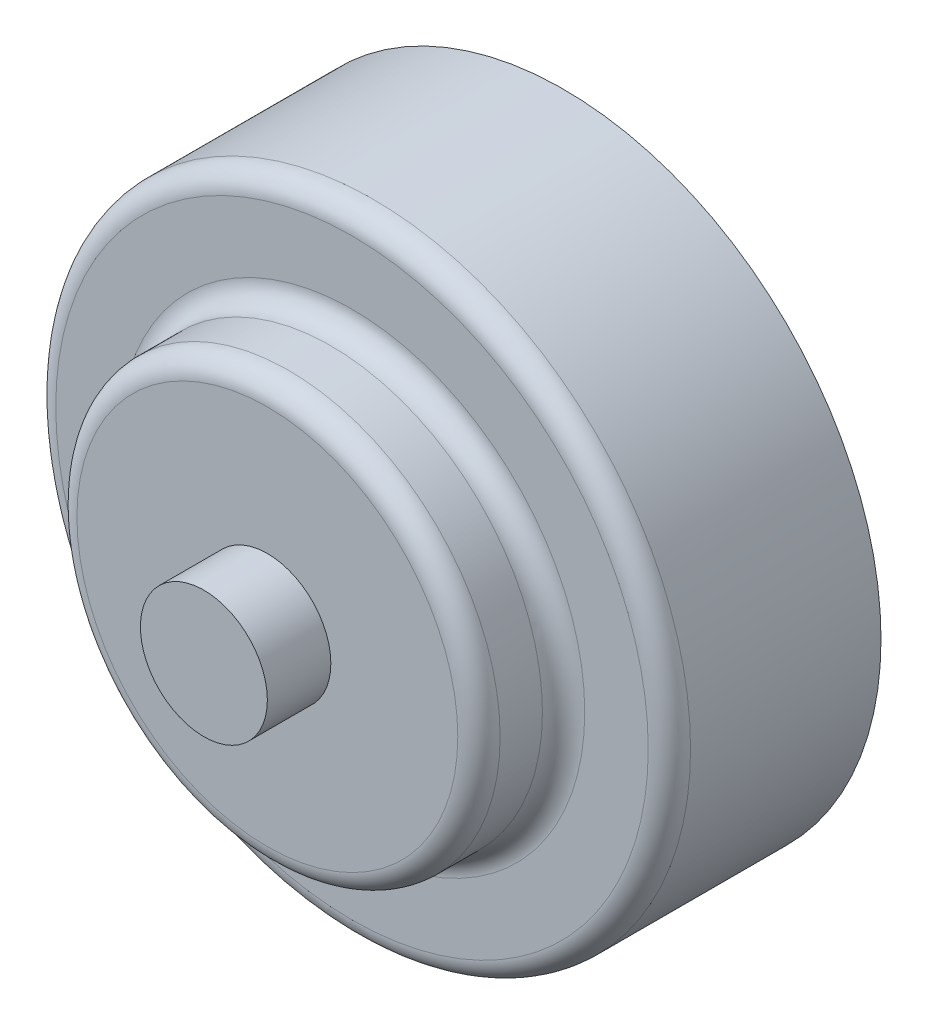
ISO-10303-21;
HEADER;
FILE_DESCRIPTION(('STEP AP214'),'2;1');
FILE_NAME('part.step','',(''),(''),'','','');
FILE_SCHEMA(('AUTOMOTIVE_DESIGN { 1 0 10303 214 1 1 1 1 }'));
ENDSEC;
DATA;
#1=APPLICATION_CONTEXT('core data for automotive mechanical design processes');
#2=APPLICATION_PROTOCOL_DEFINITION('international standard','automotive_design',2000,#1);
#3=PRODUCT_CONTEXT('',#1,'mechanical');
#4=PRODUCT('Part','Part','',(#3));
#5=PRODUCT_RELATED_PRODUCT_CATEGORY('part','',(#4));
#6=PRODUCT_DEFINITION_FORMATION('','',#4);
#7=PRODUCT_DEFINITION_CONTEXT('part definition',#1,'design');
#8=PRODUCT_DEFINITION('design','',#6,#7);
#9=PRODUCT_DEFINITION_SHAPE('','',#8);
#10=(LENGTH_UNIT() NAMED_UNIT(*) SI_UNIT(.MILLI.,.METRE.));
#11=(NAMED_UNIT(*) PLANE_ANGLE_UNIT() SI_UNIT($,.RADIAN.));
#12=(NAMED_UNIT(*) SI_UNIT($,.STERADIAN.) SOLID_ANGLE_UNIT());
#13=UNCERTAINTY_MEASURE_WITH_UNIT(LENGTH_MEASURE(1.E-05),#10,'distance_accuracy_value','');
#14=(GEOMETRIC_REPRESENTATION_CONTEXT(3) GLOBAL_UNCERTAINTY_ASSIGNED_CONTEXT((#13)) GLOBAL_UNIT_ASSIGNED_CONTEXT((#10,
#11,#12)) REPRESENTATION_CONTEXT('',''));
#15=CARTESIAN_POINT('',(0.,0.,0.));
#16=DIRECTION('',(0.,0.,1.));
#17=DIRECTION('',(1.,0.,0.));
#18=AXIS2_PLACEMENT_3D('',#15,#16,#17);
#19=CARTESIAN_POINT('',(0.,0.,50.));
#20=DIRECTION('',(0.,0.,-1.));
#21=DIRECTION('',(-1.,0.,0.));
#22=AXIS2_PLACEMENT_3D('',#19,#20,#21);
#23=CYLINDRICAL_SURFACE('',#22,75.);
#24=CARTESIAN_POINT('',(0.,0.,45.));
#25=DIRECTION('',(0.,0.,1.));
#26=DIRECTION('',(1.,0.,0.));
#27=AXIS2_PLACEMENT_3D('',#24,#25,#26);
#28=CIRCLE('',#27,75.);
#29=CARTESIAN_POINT('',(75.,0.,45.));
#30=VERTEX_POINT('',#29);
#31=EDGE_CURVE('E10',#30,#30,#28,.F.);
#32=ORIENTED_EDGE('',*,*,#31,.T.);
#33=EDGE_LOOP('',(#32));
#34=FACE_BOUND('',#33,.T.);
#35=CARTESIAN_POINT('',(0.,0.,0.));
#36=DIRECTION('',(0.,0.,1.));
#37=DIRECTION('',(1.,0.,0.));
#38=AXIS2_PLACEMENT_3D('',#35,#36,#37);
#39=CIRCLE('',#38,75.);
#40=CARTESIAN_POINT('',(75.,0.,0.));
#41=VERTEX_POINT('',#40);
#42=EDGE_CURVE('E62',#41,#41,#39,.T.);
#43=ORIENTED_EDGE('',*,*,#42,.T.);
#44=EDGE_LOOP('',(#43));
#45=FACE_BOUND('',#44,.T.);
#46=ADVANCED_FACE('F35',(#34,#45),#23,.T.);
#47=CARTESIAN_POINT('',(0.,0.,50.));
#48=DIRECTION('',(0.,0.,1.));
#49=DIRECTION('',(1.,0.,0.));
#50=AXIS2_PLACEMENT_3D('',#47,#48,#49);
#51=PLANE('',#50);
#52=CARTESIAN_POINT('',(0.,0.,50.));
#53=DIRECTION('',(0.,0.,1.));
#54=DIRECTION('',(1.,0.,0.));
#55=AXIS2_PLACEMENT_3D('',#52,#53,#54);
#56=CIRCLE('',#55,55.);
#57=CARTESIAN_POINT('',(55.,0.,50.));
#58=VERTEX_POINT('',#57);
#59=EDGE_CURVE('E42',#58,#58,#56,.F.);
#60=ORIENTED_EDGE('',*,*,#59,.T.);
#61=EDGE_LOOP('',(#60));
#62=FACE_BOUND('',#61,.T.);
#63=CARTESIAN_POINT('',(0.,0.,50.));
#64=DIRECTION('',(0.,0.,1.));
#65=DIRECTION('',(1.,0.,0.));
#66=AXIS2_PLACEMENT_3D('',#63,#64,#65);
#67=CIRCLE('',#66,70.);
#68=CARTESIAN_POINT('',(70.,0.,50.));
#69=VERTEX_POINT('',#68);
#70=EDGE_CURVE('E46',#69,#69,#67,.T.);
#71=ORIENTED_EDGE('',*,*,#70,.T.);
#72=EDGE_LOOP('',(#71));
#73=FACE_BOUND('',#72,.T.);
#74=ADVANCED_FACE('F91',(#62,#73),#51,.T.);
#75=CARTESIAN_POINT('',(0.,0.,0.));
#76=DIRECTION('',(0.,0.,1.));
#77=DIRECTION('',(1.,0.,0.));
#78=AXIS2_PLACEMENT_3D('',#75,#76,#77);
#79=PLANE('',#78);
#80=ORIENTED_EDGE('',*,*,#42,.F.);
#81=EDGE_LOOP('',(#80));
#82=FACE_BOUND('',#81,.T.);
#83=ADVANCED_FACE('F87',(#82),#79,.F.);
#84=CARTESIAN_POINT('',(0.,0.,70.));
#85=DIRECTION('',(0.,0.,-1.));
#86=DIRECTION('',(-1.,0.,0.));
#87=AXIS2_PLACEMENT_3D('',#84,#85,#86);
#88=CYLINDRICAL_SURFACE('',#87,50.);
#89=CARTESIAN_POINT('',(0.,0.,65.));
#90=DIRECTION('',(0.,0.,1.));
#91=DIRECTION('',(1.,0.,0.));
#92=AXIS2_PLACEMENT_3D('',#89,#90,#91);
#93=CIRCLE('',#92,50.);
#94=CARTESIAN_POINT('',(50.,0.,65.));
#95=VERTEX_POINT('',#94);
#96=EDGE_CURVE('E50',#95,#95,#93,.F.);
#97=ORIENTED_EDGE('',*,*,#96,.T.);
#98=EDGE_LOOP('',(#97));
#99=FACE_BOUND('',#98,.T.);
#100=CARTESIAN_POINT('',(0.,0.,55.));
#101=DIRECTION('',(0.,0.,1.));
#102=DIRECTION('',(1.,0.,0.));
#103=AXIS2_PLACEMENT_3D('',#100,#101,#102);
#104=CIRCLE('',#103,50.);
#105=CARTESIAN_POINT('',(50.,0.,55.));
#106=VERTEX_POINT('',#105);
#107=EDGE_CURVE('E55',#106,#106,#104,.T.);
#108=ORIENTED_EDGE('',*,*,#107,.T.);
#109=EDGE_LOOP('',(#108));
#110=FACE_BOUND('',#109,.T.);
#111=ADVANCED_FACE('F81',(#99,#110),#88,.T.);
#112=CARTESIAN_POINT('',(0.,0.,70.));
#113=DIRECTION('',(0.,0.,1.));
#114=DIRECTION('',(1.,0.,0.));
#115=AXIS2_PLACEMENT_3D('',#112,#113,#114);
#116=PLANE('',#115);
#117=CARTESIAN_POINT('',(0.,0.,70.));
#118=DIRECTION('',(0.,0.,1.));
#119=DIRECTION('',(1.,0.,0.));
#120=AXIS2_PLACEMENT_3D('',#117,#118,#119);
#121=CIRCLE('',#120,45.);
#122=CARTESIAN_POINT('',(45.,0.,70.));
#123=VERTEX_POINT('',#122);
#124=EDGE_CURVE('E58',#123,#123,#121,.T.);
#125=ORIENTED_EDGE('',*,*,#124,.T.);
#126=EDGE_LOOP('',(#125));
#127=FACE_BOUND('',#126,.T.);
#128=CARTESIAN_POINT('',(0.,0.,70.));
#129=DIRECTION('',(0.,0.,1.));
#130=DIRECTION('',(1.,0.,0.));
#131=AXIS2_PLACEMENT_3D('',#128,#129,#130);
#132=CIRCLE('',#131,15.);
#133=CARTESIAN_POINT('',(15.,0.,70.));
#134=VERTEX_POINT('',#133);
#135=EDGE_CURVE('E61',#134,#134,#132,.T.);
#136=ORIENTED_EDGE('',*,*,#135,.F.);
#137=EDGE_LOOP('',(#136));
#138=FACE_BOUND('',#137,.T.);
#139=ADVANCED_FACE('F76',(#127,#138),#116,.T.);
#140=CARTESIAN_POINT('',(0.,0.,85.));
#141=DIRECTION('',(0.,0.,-1.));
#142=DIRECTION('',(-1.,0.,0.));
#143=AXIS2_PLACEMENT_3D('',#140,#141,#142);
#144=CYLINDRICAL_SURFACE('',#143,15.);
#145=CARTESIAN_POINT('',(0.,0.,85.));
#146=DIRECTION('',(0.,0.,1.));
#147=DIRECTION('',(1.,0.,0.));
#148=AXIS2_PLACEMENT_3D('',#145,#146,#147);
#149=CIRCLE('',#148,15.);
#150=CARTESIAN_POINT('',(15.,0.,85.));
#151=VERTEX_POINT('',#150);
#152=EDGE_CURVE('E65',#151,#151,#149,.T.);
#153=ORIENTED_EDGE('',*,*,#152,.F.);
#154=EDGE_LOOP('',(#153));
#155=FACE_BOUND('',#154,.T.);
#156=ORIENTED_EDGE('',*,*,#135,.T.);
#157=EDGE_LOOP('',(#156));
#158=FACE_BOUND('',#157,.T.);
#159=ADVANCED_FACE('F73',(#155,#158),#144,.T.);
#160=CARTESIAN_POINT('',(0.,0.,85.));
#161=DIRECTION('',(0.,0.,1.));
#162=DIRECTION('',(1.,0.,0.));
#163=AXIS2_PLACEMENT_3D('',#160,#161,#162);
#164=PLANE('',#163);
#165=ORIENTED_EDGE('',*,*,#152,.T.);
#166=EDGE_LOOP('',(#165));
#167=FACE_BOUND('',#166,.T.);
#168=ADVANCED_FACE('F71',(#167),#164,.T.);
#169=CARTESIAN_POINT('',(0.,0.,65.));
#170=DIRECTION('',(0.,0.,1.));
#171=DIRECTION('',(1.,0.,0.));
#172=AXIS2_PLACEMENT_3D('',#169,#170,#171);
#173=TOROIDAL_SURFACE('',#172,45.,5.);
#174=ORIENTED_EDGE('',*,*,#96,.F.);
#175=EDGE_LOOP('',(#174));
#176=FACE_BOUND('',#175,.T.);
#177=ORIENTED_EDGE('',*,*,#124,.F.);
#178=EDGE_LOOP('',(#177));
#179=FACE_BOUND('',#178,.T.);
#180=ADVANCED_FACE('F100',(#176,#179),#173,.T.);
#181=CARTESIAN_POINT('',(0.,0.,55.));
#182=DIRECTION('',(0.,0.,1.));
#183=DIRECTION('',(1.,0.,0.));
#184=AXIS2_PLACEMENT_3D('',#181,#182,#183);
#185=TOROIDAL_SURFACE('',#184,55.,5.);
#186=ORIENTED_EDGE('',*,*,#59,.F.);
#187=EDGE_LOOP('',(#186));
#188=FACE_BOUND('',#187,.T.);
#189=ORIENTED_EDGE('',*,*,#107,.F.);
#190=EDGE_LOOP('',(#189));
#191=FACE_BOUND('',#190,.T.);
#192=ADVANCED_FACE('F102',(#188,#191),#185,.F.);
#193=CARTESIAN_POINT('',(0.,0.,45.));
#194=DIRECTION('',(0.,0.,1.));
#195=DIRECTION('',(1.,0.,0.));
#196=AXIS2_PLACEMENT_3D('',#193,#194,#195);
#197=TOROIDAL_SURFACE('',#196,70.,5.);
#198=ORIENTED_EDGE('',*,*,#31,.F.);
#199=EDGE_LOOP('',(#198));
#200=FACE_BOUND('',#199,.T.);
#201=ORIENTED_EDGE('',*,*,#70,.F.);
#202=EDGE_LOOP('',(#201));
#203=FACE_BOUND('',#202,.T.);
#204=ADVANCED_FACE('F37',(#200,#203),#197,.T.);
#205=CLOSED_SHELL('',(#46,#74,#83,#111,#139,#159,#168,#180,#192,#204));
#206=MANIFOLD_SOLID_BREP('B2',#205);
#207=ADVANCED_BREP_SHAPE_REPRESENTATION('',(#18,#206),#14);
#208=SHAPE_DEFINITION_REPRESENTATION(#9,#207);
ENDSEC;
END-ISO-10303-21;
